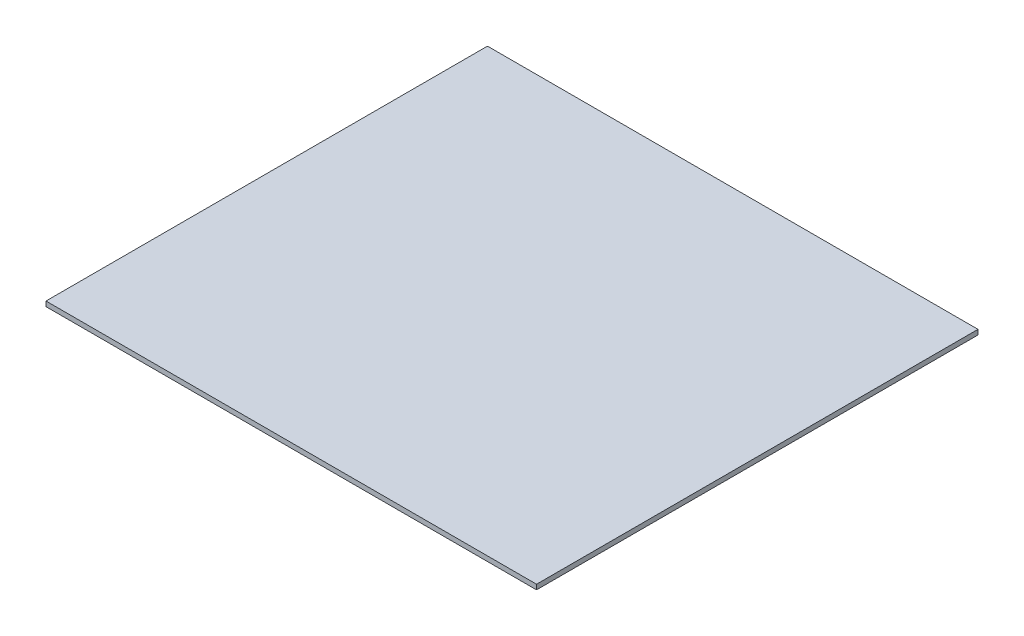
ISO-10303-21;
HEADER;
FILE_DESCRIPTION(('STEP AP214'),'2;1');
FILE_NAME('part.step','',(''),(''),'','','');
FILE_SCHEMA(('AUTOMOTIVE_DESIGN { 1 0 10303 214 1 1 1 1 }'));
ENDSEC;
DATA;
#1=APPLICATION_CONTEXT('core data for automotive mechanical design processes');
#2=APPLICATION_PROTOCOL_DEFINITION('international standard','automotive_design',2000,#1);
#3=PRODUCT_CONTEXT('',#1,'mechanical');
#4=PRODUCT('Part','Part','',(#3));
#5=PRODUCT_RELATED_PRODUCT_CATEGORY('part','',(#4));
#6=PRODUCT_DEFINITION_FORMATION('','',#4);
#7=PRODUCT_DEFINITION_CONTEXT('part definition',#1,'design');
#8=PRODUCT_DEFINITION('design','',#6,#7);
#9=PRODUCT_DEFINITION_SHAPE('','',#8);
#10=(LENGTH_UNIT() NAMED_UNIT(*) SI_UNIT(.MILLI.,.METRE.));
#11=(NAMED_UNIT(*) PLANE_ANGLE_UNIT() SI_UNIT($,.RADIAN.));
#12=(NAMED_UNIT(*) SI_UNIT($,.STERADIAN.) SOLID_ANGLE_UNIT());
#13=UNCERTAINTY_MEASURE_WITH_UNIT(LENGTH_MEASURE(1.E-05),#10,'distance_accuracy_value','');
#14=(GEOMETRIC_REPRESENTATION_CONTEXT(3) GLOBAL_UNCERTAINTY_ASSIGNED_CONTEXT((#13)) GLOBAL_UNIT_ASSIGNED_CONTEXT((#10,
#11,#12)) REPRESENTATION_CONTEXT('',''));
#15=CARTESIAN_POINT('',(0.,0.,0.));
#16=DIRECTION('',(0.,0.,1.));
#17=DIRECTION('',(1.,0.,0.));
#18=AXIS2_PLACEMENT_3D('',#15,#16,#17);
#19=CARTESIAN_POINT('',(500.,10.,-450.));
#20=DIRECTION('',(-1.,0.,0.));
#21=DIRECTION('',(0.,0.,1.));
#22=AXIS2_PLACEMENT_3D('',#19,#20,#21);
#23=PLANE('',#22);
#24=DIRECTION('',(0.,0.,-1.));
#25=VECTOR('',#24,1.);
#26=CARTESIAN_POINT('',(500.,0.,-450.));
#27=LINE('',#26,#25);
#28=CARTESIAN_POINT('',(500.,0.,450.));
#29=VERTEX_POINT('',#28);
#30=CARTESIAN_POINT('',(500.,0.,-450.));
#31=VERTEX_POINT('',#30);
#32=EDGE_CURVE('E97',#29,#31,#27,.T.);
#33=ORIENTED_EDGE('',*,*,#32,.T.);
#34=DIRECTION('',(0.,-1.,0.));
#35=VECTOR('',#34,1.);
#36=CARTESIAN_POINT('',(500.,10.,-450.));
#37=LINE('',#36,#35);
#38=CARTESIAN_POINT('',(500.,10.,-450.));
#39=VERTEX_POINT('',#38);
#40=EDGE_CURVE('E11',#39,#31,#37,.T.);
#41=ORIENTED_EDGE('',*,*,#40,.F.);
#42=DIRECTION('',(0.,0.,-1.));
#43=VECTOR('',#42,1.);
#44=CARTESIAN_POINT('',(500.,10.,-450.));
#45=LINE('',#44,#43);
#46=CARTESIAN_POINT('',(500.,10.,450.));
#47=VERTEX_POINT('',#46);
#48=EDGE_CURVE('E85',#47,#39,#45,.T.);
#49=ORIENTED_EDGE('',*,*,#48,.F.);
#50=DIRECTION('',(0.,-1.,0.));
#51=VECTOR('',#50,1.);
#52=CARTESIAN_POINT('',(500.,10.,450.));
#53=LINE('',#52,#51);
#54=EDGE_CURVE('E93',#47,#29,#53,.T.);
#55=ORIENTED_EDGE('',*,*,#54,.T.);
#56=EDGE_LOOP('',(#33,#41,#49,#55));
#57=FACE_BOUND('',#56,.T.);
#58=ADVANCED_FACE('F34',(#57),#23,.F.);
#59=CARTESIAN_POINT('',(-500.,10.,-450.));
#60=DIRECTION('',(0.,0.,1.));
#61=DIRECTION('',(1.,0.,0.));
#62=AXIS2_PLACEMENT_3D('',#59,#60,#61);
#63=PLANE('',#62);
#64=DIRECTION('',(-1.,0.,0.));
#65=VECTOR('',#64,1.);
#66=CARTESIAN_POINT('',(-500.,0.,-450.));
#67=LINE('',#66,#65);
#68=CARTESIAN_POINT('',(-500.,0.,-450.));
#69=VERTEX_POINT('',#68);
#70=EDGE_CURVE('E89',#31,#69,#67,.T.);
#71=ORIENTED_EDGE('',*,*,#70,.T.);
#72=DIRECTION('',(0.,-1.,0.));
#73=VECTOR('',#72,1.);
#74=CARTESIAN_POINT('',(-500.,10.,-450.));
#75=LINE('',#74,#73);
#76=CARTESIAN_POINT('',(-500.,10.,-450.));
#77=VERTEX_POINT('',#76);
#78=EDGE_CURVE('E42',#77,#69,#75,.T.);
#79=ORIENTED_EDGE('',*,*,#78,.F.);
#80=DIRECTION('',(-1.,0.,0.));
#81=VECTOR('',#80,1.);
#82=CARTESIAN_POINT('',(-500.,10.,-450.));
#83=LINE('',#82,#81);
#84=EDGE_CURVE('E80',#39,#77,#83,.T.);
#85=ORIENTED_EDGE('',*,*,#84,.F.);
#86=ORIENTED_EDGE('',*,*,#40,.T.);
#87=EDGE_LOOP('',(#71,#79,#85,#86));
#88=FACE_BOUND('',#87,.T.);
#89=ADVANCED_FACE('F88',(#88),#63,.F.);
#90=CARTESIAN_POINT('',(-500.,10.,-450.));
#91=DIRECTION('',(1.,0.,0.));
#92=DIRECTION('',(0.,0.,-1.));
#93=AXIS2_PLACEMENT_3D('',#90,#91,#92);
#94=PLANE('',#93);
#95=DIRECTION('',(0.,0.,1.));
#96=VECTOR('',#95,1.);
#97=CARTESIAN_POINT('',(-500.,0.,-450.));
#98=LINE('',#97,#96);
#99=CARTESIAN_POINT('',(-500.,0.,450.));
#100=VERTEX_POINT('',#99);
#101=EDGE_CURVE('E67',#69,#100,#98,.T.);
#102=ORIENTED_EDGE('',*,*,#101,.T.);
#103=DIRECTION('',(0.,-1.,0.));
#104=VECTOR('',#103,1.);
#105=CARTESIAN_POINT('',(-500.,10.,450.));
#106=LINE('',#105,#104);
#107=CARTESIAN_POINT('',(-500.,10.,450.));
#108=VERTEX_POINT('',#107);
#109=EDGE_CURVE('E90',#108,#100,#106,.T.);
#110=ORIENTED_EDGE('',*,*,#109,.F.);
#111=DIRECTION('',(0.,0.,1.));
#112=VECTOR('',#111,1.);
#113=CARTESIAN_POINT('',(-500.,10.,-450.));
#114=LINE('',#113,#112);
#115=EDGE_CURVE('E83',#77,#108,#114,.T.);
#116=ORIENTED_EDGE('',*,*,#115,.F.);
#117=ORIENTED_EDGE('',*,*,#78,.T.);
#118=EDGE_LOOP('',(#102,#110,#116,#117));
#119=FACE_BOUND('',#118,.T.);
#120=ADVANCED_FACE('F91',(#119),#94,.F.);
#121=CARTESIAN_POINT('',(-500.,10.,450.));
#122=DIRECTION('',(0.,0.,-1.));
#123=DIRECTION('',(-1.,0.,0.));
#124=AXIS2_PLACEMENT_3D('',#121,#122,#123);
#125=PLANE('',#124);
#126=DIRECTION('',(1.,0.,0.));
#127=VECTOR('',#126,1.);
#128=CARTESIAN_POINT('',(-500.,0.,450.));
#129=LINE('',#128,#127);
#130=EDGE_CURVE('E73',#100,#29,#129,.T.);
#131=ORIENTED_EDGE('',*,*,#130,.T.);
#132=ORIENTED_EDGE('',*,*,#54,.F.);
#133=DIRECTION('',(1.,0.,0.));
#134=VECTOR('',#133,1.);
#135=CARTESIAN_POINT('',(-500.,10.,450.));
#136=LINE('',#135,#134);
#137=EDGE_CURVE('E50',#108,#47,#136,.T.);
#138=ORIENTED_EDGE('',*,*,#137,.F.);
#139=ORIENTED_EDGE('',*,*,#109,.T.);
#140=EDGE_LOOP('',(#131,#132,#138,#139));
#141=FACE_BOUND('',#140,.T.);
#142=ADVANCED_FACE('F104',(#141),#125,.F.);
#143=CARTESIAN_POINT('',(0.,10.,0.));
#144=DIRECTION('',(0.,1.,0.));
#145=DIRECTION('',(0.,0.,1.));
#146=AXIS2_PLACEMENT_3D('',#143,#144,#145);
#147=PLANE('',#146);
#148=ORIENTED_EDGE('',*,*,#48,.T.);
#149=ORIENTED_EDGE('',*,*,#84,.T.);
#150=ORIENTED_EDGE('',*,*,#115,.T.);
#151=ORIENTED_EDGE('',*,*,#137,.T.);
#152=EDGE_LOOP('',(#148,#149,#150,#151));
#153=FACE_BOUND('',#152,.T.);
#154=ADVANCED_FACE('F81',(#153),#147,.T.);
#155=CARTESIAN_POINT('',(0.,0.,0.));
#156=DIRECTION('',(0.,1.,0.));
#157=DIRECTION('',(0.,0.,1.));
#158=AXIS2_PLACEMENT_3D('',#155,#156,#157);
#159=PLANE('',#158);
#160=ORIENTED_EDGE('',*,*,#32,.F.);
#161=ORIENTED_EDGE('',*,*,#130,.F.);
#162=ORIENTED_EDGE('',*,*,#101,.F.);
#163=ORIENTED_EDGE('',*,*,#70,.F.);
#164=EDGE_LOOP('',(#160,#161,#162,#163));
#165=FACE_BOUND('',#164,.T.);
#166=ADVANCED_FACE('F107',(#165),#159,.F.);
#167=CLOSED_SHELL('',(#58,#89,#120,#142,#154,#166));
#168=MANIFOLD_SOLID_BREP('B2',#167);
#169=ADVANCED_BREP_SHAPE_REPRESENTATION('',(#18,#168),#14);
#170=SHAPE_DEFINITION_REPRESENTATION(#9,#169);
ENDSEC;
END-ISO-10303-21;
